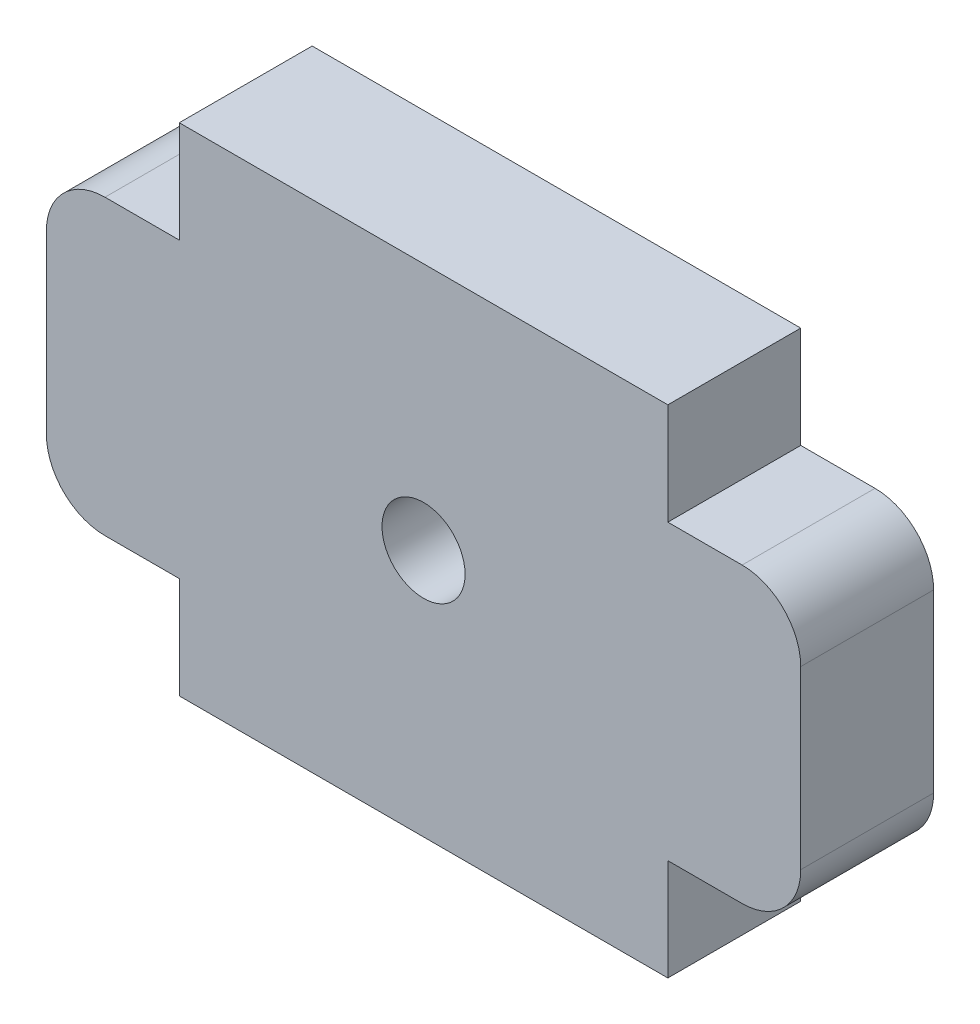
ISO-10303-21;
HEADER;
FILE_DESCRIPTION(('STEP AP214'),'2;1');
FILE_NAME('part.step','',(''),(''),'','','');
FILE_SCHEMA(('AUTOMOTIVE_DESIGN { 1 0 10303 214 1 1 1 1 }'));
ENDSEC;
DATA;
#1=APPLICATION_CONTEXT('core data for automotive mechanical design processes');
#2=APPLICATION_PROTOCOL_DEFINITION('international standard','automotive_design',2000,#1);
#3=PRODUCT_CONTEXT('',#1,'mechanical');
#4=PRODUCT('Part','Part','',(#3));
#5=PRODUCT_RELATED_PRODUCT_CATEGORY('part','',(#4));
#6=PRODUCT_DEFINITION_FORMATION('','',#4);
#7=PRODUCT_DEFINITION_CONTEXT('part definition',#1,'design');
#8=PRODUCT_DEFINITION('design','',#6,#7);
#9=PRODUCT_DEFINITION_SHAPE('','',#8);
#10=(LENGTH_UNIT() NAMED_UNIT(*) SI_UNIT(.MILLI.,.METRE.));
#11=(NAMED_UNIT(*) PLANE_ANGLE_UNIT() SI_UNIT($,.RADIAN.));
#12=(NAMED_UNIT(*) SI_UNIT($,.STERADIAN.) SOLID_ANGLE_UNIT());
#13=UNCERTAINTY_MEASURE_WITH_UNIT(LENGTH_MEASURE(1.E-05),#10,'distance_accuracy_value','');
#14=(GEOMETRIC_REPRESENTATION_CONTEXT(3) GLOBAL_UNCERTAINTY_ASSIGNED_CONTEXT((#13)) GLOBAL_UNIT_ASSIGNED_CONTEXT((#10,
#11,#12)) REPRESENTATION_CONTEXT('',''));
#15=CARTESIAN_POINT('',(0.,0.,0.));
#16=DIRECTION('',(0.,0.,1.));
#17=DIRECTION('',(1.,0.,0.));
#18=AXIS2_PLACEMENT_3D('',#15,#16,#17);
#19=CARTESIAN_POINT('',(-12.5,-12.7,6.8));
#20=DIRECTION('',(1.,0.,0.));
#21=DIRECTION('',(0.,0.,-1.));
#22=AXIS2_PLACEMENT_3D('',#19,#20,#21);
#23=PLANE('',#22);
#24=DIRECTION('',(0.,0.,1.));
#25=VECTOR('',#24,1.);
#26=CARTESIAN_POINT('',(-12.5,-7.5,0.));
#27=LINE('',#26,#25);
#28=CARTESIAN_POINT('',(-12.5,-7.5,0.));
#29=VERTEX_POINT('',#28);
#30=CARTESIAN_POINT('',(-12.5,-7.5,6.8));
#31=VERTEX_POINT('',#30);
#32=EDGE_CURVE('E168',#29,#31,#27,.T.);
#33=ORIENTED_EDGE('',*,*,#32,.F.);
#34=DIRECTION('',(0.,-1.,0.));
#35=VECTOR('',#34,1.);
#36=CARTESIAN_POINT('',(-12.5,-12.7,0.));
#37=LINE('',#36,#35);
#38=CARTESIAN_POINT('',(-12.5,-12.7,0.));
#39=VERTEX_POINT('',#38);
#40=EDGE_CURVE('E176',#29,#39,#37,.T.);
#41=ORIENTED_EDGE('',*,*,#40,.T.);
#42=DIRECTION('',(0.,0.,-1.));
#43=VECTOR('',#42,1.);
#44=CARTESIAN_POINT('',(-12.5,-12.7,6.8));
#45=LINE('',#44,#43);
#46=CARTESIAN_POINT('',(-12.5,-12.7,6.8));
#47=VERTEX_POINT('',#46);
#48=EDGE_CURVE('E204',#47,#39,#45,.T.);
#49=ORIENTED_EDGE('',*,*,#48,.F.);
#50=DIRECTION('',(0.,-1.,0.));
#51=VECTOR('',#50,1.);
#52=CARTESIAN_POINT('',(-12.5,-12.7,6.8));
#53=LINE('',#52,#51);
#54=EDGE_CURVE('E234',#31,#47,#53,.T.);
#55=ORIENTED_EDGE('',*,*,#54,.F.);
#56=EDGE_LOOP('',(#33,#41,#49,#55));
#57=FACE_BOUND('',#56,.T.);
#58=ADVANCED_FACE('F33',(#57),#23,.F.);
#59=CARTESIAN_POINT('',(12.5,-12.7,6.8));
#60=DIRECTION('',(-1.,0.,0.));
#61=DIRECTION('',(0.,0.,1.));
#62=AXIS2_PLACEMENT_3D('',#59,#60,#61);
#63=PLANE('',#62);
#64=DIRECTION('',(0.,0.,1.));
#65=VECTOR('',#64,1.);
#66=CARTESIAN_POINT('',(12.5,7.5,0.));
#67=LINE('',#66,#65);
#68=CARTESIAN_POINT('',(12.5,7.5,0.));
#69=VERTEX_POINT('',#68);
#70=CARTESIAN_POINT('',(12.5,7.5,6.8));
#71=VERTEX_POINT('',#70);
#72=EDGE_CURVE('E180',#69,#71,#67,.T.);
#73=ORIENTED_EDGE('',*,*,#72,.F.);
#74=DIRECTION('',(0.,1.,0.));
#75=VECTOR('',#74,1.);
#76=CARTESIAN_POINT('',(12.5,-12.7,0.));
#77=LINE('',#76,#75);
#78=CARTESIAN_POINT('',(12.5,12.7,0.));
#79=VERTEX_POINT('',#78);
#80=EDGE_CURVE('E178',#69,#79,#77,.T.);
#81=ORIENTED_EDGE('',*,*,#80,.T.);
#82=DIRECTION('',(0.,0.,-1.));
#83=VECTOR('',#82,1.);
#84=CARTESIAN_POINT('',(12.5,12.7,6.8));
#85=LINE('',#84,#83);
#86=CARTESIAN_POINT('',(12.5,12.7,6.8));
#87=VERTEX_POINT('',#86);
#88=EDGE_CURVE('E211',#87,#79,#85,.T.);
#89=ORIENTED_EDGE('',*,*,#88,.F.);
#90=DIRECTION('',(0.,1.,0.));
#91=VECTOR('',#90,1.);
#92=CARTESIAN_POINT('',(12.5,-12.7,6.8));
#93=LINE('',#92,#91);
#94=EDGE_CURVE('E217',#71,#87,#93,.T.);
#95=ORIENTED_EDGE('',*,*,#94,.F.);
#96=EDGE_LOOP('',(#73,#81,#89,#95));
#97=FACE_BOUND('',#96,.T.);
#98=ADVANCED_FACE('F246',(#97),#63,.F.);
#99=CARTESIAN_POINT('',(-12.5,12.7,0.));
#100=VERTEX_POINT('',#99);
#101=CARTESIAN_POINT('',(-12.5,7.5,0.));
#102=VERTEX_POINT('',#101);
#103=EDGE_CURVE('E152',#100,#102,#37,.T.);
#104=ORIENTED_EDGE('',*,*,#103,.T.);
#105=DIRECTION('',(0.,0.,1.));
#106=VECTOR('',#105,1.);
#107=CARTESIAN_POINT('',(-12.5,7.5,0.));
#108=LINE('',#107,#106);
#109=CARTESIAN_POINT('',(-12.5,7.5,6.8));
#110=VERTEX_POINT('',#109);
#111=EDGE_CURVE('E161',#102,#110,#108,.T.);
#112=ORIENTED_EDGE('',*,*,#111,.T.);
#113=CARTESIAN_POINT('',(-12.5,12.7,6.8));
#114=VERTEX_POINT('',#113);
#115=EDGE_CURVE('E227',#114,#110,#53,.T.);
#116=ORIENTED_EDGE('',*,*,#115,.F.);
#117=DIRECTION('',(0.,0.,-1.));
#118=VECTOR('',#117,1.);
#119=CARTESIAN_POINT('',(-12.5,12.7,6.8));
#120=LINE('',#119,#118);
#121=EDGE_CURVE('E174',#114,#100,#120,.T.);
#122=ORIENTED_EDGE('',*,*,#121,.T.);
#123=EDGE_LOOP('',(#104,#112,#116,#122));
#124=FACE_BOUND('',#123,.T.);
#125=ADVANCED_FACE('F172',(#124),#23,.F.);
#126=CARTESIAN_POINT('',(12.5,-12.7,6.8));
#127=DIRECTION('',(0.,1.,0.));
#128=DIRECTION('',(-1.,0.,0.));
#129=AXIS2_PLACEMENT_3D('',#126,#127,#128);
#130=PLANE('',#129);
#131=DIRECTION('',(1.,0.,0.));
#132=VECTOR('',#131,1.);
#133=CARTESIAN_POINT('',(12.5,-12.7,0.));
#134=LINE('',#133,#132);
#135=CARTESIAN_POINT('',(12.5,-12.7,0.));
#136=VERTEX_POINT('',#135);
#137=EDGE_CURVE('E175',#39,#136,#134,.T.);
#138=ORIENTED_EDGE('',*,*,#137,.T.);
#139=DIRECTION('',(0.,0.,-1.));
#140=VECTOR('',#139,1.);
#141=CARTESIAN_POINT('',(12.5,-12.7,6.8));
#142=LINE('',#141,#140);
#143=CARTESIAN_POINT('',(12.5,-12.7,6.8));
#144=VERTEX_POINT('',#143);
#145=EDGE_CURVE('E208',#144,#136,#142,.T.);
#146=ORIENTED_EDGE('',*,*,#145,.F.);
#147=DIRECTION('',(1.,0.,0.));
#148=VECTOR('',#147,1.);
#149=CARTESIAN_POINT('',(12.5,-12.7,6.8));
#150=LINE('',#149,#148);
#151=EDGE_CURVE('E220',#47,#144,#150,.T.);
#152=ORIENTED_EDGE('',*,*,#151,.F.);
#153=ORIENTED_EDGE('',*,*,#48,.T.);
#154=EDGE_LOOP('',(#138,#146,#152,#153));
#155=FACE_BOUND('',#154,.T.);
#156=ADVANCED_FACE('F372',(#155),#130,.F.);
#157=CARTESIAN_POINT('',(12.5,-7.5,0.));
#158=VERTEX_POINT('',#157);
#159=EDGE_CURVE('E201',#136,#158,#77,.T.);
#160=ORIENTED_EDGE('',*,*,#159,.T.);
#161=DIRECTION('',(0.,0.,1.));
#162=VECTOR('',#161,1.);
#163=CARTESIAN_POINT('',(12.5,-7.5,0.));
#164=LINE('',#163,#162);
#165=CARTESIAN_POINT('',(12.5,-7.5,6.8));
#166=VERTEX_POINT('',#165);
#167=EDGE_CURVE('E251',#158,#166,#164,.T.);
#168=ORIENTED_EDGE('',*,*,#167,.T.);
#169=EDGE_CURVE('E213',#144,#166,#93,.T.);
#170=ORIENTED_EDGE('',*,*,#169,.F.);
#171=ORIENTED_EDGE('',*,*,#145,.T.);
#172=EDGE_LOOP('',(#160,#168,#170,#171));
#173=FACE_BOUND('',#172,.T.);
#174=ADVANCED_FACE('F368',(#173),#63,.F.);
#175=CARTESIAN_POINT('',(12.5,12.7,6.8));
#176=DIRECTION('',(0.,-1.,0.));
#177=DIRECTION('',(1.,0.,0.));
#178=AXIS2_PLACEMENT_3D('',#175,#176,#177);
#179=PLANE('',#178);
#180=DIRECTION('',(-1.,0.,0.));
#181=VECTOR('',#180,1.);
#182=CARTESIAN_POINT('',(12.5,12.7,0.));
#183=LINE('',#182,#181);
#184=EDGE_CURVE('E195',#79,#100,#183,.T.);
#185=ORIENTED_EDGE('',*,*,#184,.T.);
#186=ORIENTED_EDGE('',*,*,#121,.F.);
#187=DIRECTION('',(-1.,0.,0.));
#188=VECTOR('',#187,1.);
#189=CARTESIAN_POINT('',(12.5,12.7,6.8));
#190=LINE('',#189,#188);
#191=EDGE_CURVE('E189',#87,#114,#190,.T.);
#192=ORIENTED_EDGE('',*,*,#191,.F.);
#193=ORIENTED_EDGE('',*,*,#88,.T.);
#194=EDGE_LOOP('',(#185,#186,#192,#193));
#195=FACE_BOUND('',#194,.T.);
#196=ADVANCED_FACE('F238',(#195),#179,.F.);
#197=CARTESIAN_POINT('',(0.,0.,6.8));
#198=DIRECTION('',(0.,0.,1.));
#199=DIRECTION('',(1.,0.,0.));
#200=AXIS2_PLACEMENT_3D('',#197,#198,#199);
#201=PLANE('',#200);
#202=CARTESIAN_POINT('',(0.,0.,6.8));
#203=DIRECTION('',(0.,0.,1.));
#204=DIRECTION('',(1.,0.,0.));
#205=AXIS2_PLACEMENT_3D('',#202,#203,#204);
#206=CIRCLE('',#205,2.125);
#207=CARTESIAN_POINT('',(2.125,0.,6.8));
#208=VERTEX_POINT('',#207);
#209=EDGE_CURVE('E419',#208,#208,#206,.T.);
#210=ORIENTED_EDGE('',*,*,#209,.F.);
#211=EDGE_LOOP('',(#210));
#212=FACE_BOUND('',#211,.T.);
#213=DIRECTION('',(1.,0.,0.));
#214=VECTOR('',#213,1.);
#215=CARTESIAN_POINT('',(-19.3,7.5,6.8));
#216=LINE('',#215,#214);
#217=CARTESIAN_POINT('',(-16.3,7.5,6.8));
#218=VERTEX_POINT('',#217);
#219=EDGE_CURVE('E164',#218,#110,#216,.T.);
#220=ORIENTED_EDGE('',*,*,#219,.F.);
#221=CARTESIAN_POINT('',(-16.3,4.5,6.8));
#222=DIRECTION('',(0.,0.,1.));
#223=DIRECTION('',(1.,0.,0.));
#224=AXIS2_PLACEMENT_3D('',#221,#222,#223);
#225=CIRCLE('',#224,3.);
#226=CARTESIAN_POINT('',(-19.3,4.5,6.8));
#227=VERTEX_POINT('',#226);
#228=EDGE_CURVE('E292',#218,#227,#225,.T.);
#229=ORIENTED_EDGE('',*,*,#228,.T.);
#230=DIRECTION('',(0.,1.,0.));
#231=VECTOR('',#230,1.);
#232=CARTESIAN_POINT('',(-19.3,-7.5,6.8));
#233=LINE('',#232,#231);
#234=CARTESIAN_POINT('',(-19.3,-4.5,6.8));
#235=VERTEX_POINT('',#234);
#236=EDGE_CURVE('E283',#235,#227,#233,.T.);
#237=ORIENTED_EDGE('',*,*,#236,.F.);
#238=CARTESIAN_POINT('',(-16.3,-4.5,6.8));
#239=DIRECTION('',(0.,0.,1.));
#240=DIRECTION('',(1.,0.,0.));
#241=AXIS2_PLACEMENT_3D('',#238,#239,#240);
#242=CIRCLE('',#241,3.);
#243=CARTESIAN_POINT('',(-16.3,-7.5,6.8));
#244=VERTEX_POINT('',#243);
#245=EDGE_CURVE('E290',#235,#244,#242,.T.);
#246=ORIENTED_EDGE('',*,*,#245,.T.);
#247=DIRECTION('',(-1.,0.,0.));
#248=VECTOR('',#247,1.);
#249=CARTESIAN_POINT('',(-19.3,-7.5,6.8));
#250=LINE('',#249,#248);
#251=EDGE_CURVE('E158',#31,#244,#250,.T.);
#252=ORIENTED_EDGE('',*,*,#251,.F.);
#253=ORIENTED_EDGE('',*,*,#54,.T.);
#254=ORIENTED_EDGE('',*,*,#151,.T.);
#255=ORIENTED_EDGE('',*,*,#169,.T.);
#256=DIRECTION('',(1.,0.,0.));
#257=VECTOR('',#256,1.);
#258=CARTESIAN_POINT('',(19.3,-7.5,6.8));
#259=LINE('',#258,#257);
#260=CARTESIAN_POINT('',(16.3,-7.5,6.8));
#261=VERTEX_POINT('',#260);
#262=EDGE_CURVE('E267',#166,#261,#259,.T.);
#263=ORIENTED_EDGE('',*,*,#262,.T.);
#264=CARTESIAN_POINT('',(16.3,-4.5,6.8));
#265=DIRECTION('',(0.,0.,1.));
#266=DIRECTION('',(1.,0.,0.));
#267=AXIS2_PLACEMENT_3D('',#264,#265,#266);
#268=CIRCLE('',#267,3.);
#269=CARTESIAN_POINT('',(19.3,-4.5,6.8));
#270=VERTEX_POINT('',#269);
#271=EDGE_CURVE('E325',#261,#270,#268,.T.);
#272=ORIENTED_EDGE('',*,*,#271,.T.);
#273=DIRECTION('',(0.,1.,0.));
#274=VECTOR('',#273,1.);
#275=CARTESIAN_POINT('',(19.3,-7.5,6.8));
#276=LINE('',#275,#274);
#277=CARTESIAN_POINT('',(19.3,4.5,6.8));
#278=VERTEX_POINT('',#277);
#279=EDGE_CURVE('E263',#270,#278,#276,.T.);
#280=ORIENTED_EDGE('',*,*,#279,.T.);
#281=CARTESIAN_POINT('',(16.3,4.5,6.8));
#282=DIRECTION('',(0.,0.,1.));
#283=DIRECTION('',(1.,0.,0.));
#284=AXIS2_PLACEMENT_3D('',#281,#282,#283);
#285=CIRCLE('',#284,3.);
#286=CARTESIAN_POINT('',(16.3,7.5,6.8));
#287=VERTEX_POINT('',#286);
#288=EDGE_CURVE('E334',#278,#287,#285,.T.);
#289=ORIENTED_EDGE('',*,*,#288,.T.);
#290=DIRECTION('',(-1.,0.,0.));
#291=VECTOR('',#290,1.);
#292=CARTESIAN_POINT('',(19.3,7.5,6.8));
#293=LINE('',#292,#291);
#294=EDGE_CURVE('E266',#287,#71,#293,.T.);
#295=ORIENTED_EDGE('',*,*,#294,.T.);
#296=ORIENTED_EDGE('',*,*,#94,.T.);
#297=ORIENTED_EDGE('',*,*,#191,.T.);
#298=ORIENTED_EDGE('',*,*,#115,.T.);
#299=EDGE_LOOP('',(#220,#229,#237,#246,#252,#253,#254,#255,#263,#272,#280,#289,#295,#296,#297,#298));
#300=FACE_BOUND('',#299,.T.);
#301=ADVANCED_FACE('F306',(#212,#300),#201,.T.);
#302=CARTESIAN_POINT('',(0.,0.,0.));
#303=DIRECTION('',(0.,0.,1.));
#304=DIRECTION('',(1.,0.,0.));
#305=AXIS2_PLACEMENT_3D('',#302,#303,#304);
#306=PLANE('',#305);
#307=CARTESIAN_POINT('',(0.,0.,0.));
#308=DIRECTION('',(0.,0.,1.));
#309=DIRECTION('',(1.,0.,0.));
#310=AXIS2_PLACEMENT_3D('',#307,#308,#309);
#311=CIRCLE('',#310,2.125);
#312=CARTESIAN_POINT('',(2.125,0.,0.));
#313=VERTEX_POINT('',#312);
#314=EDGE_CURVE('E284',#313,#313,#311,.T.);
#315=ORIENTED_EDGE('',*,*,#314,.T.);
#316=EDGE_LOOP('',(#315));
#317=FACE_BOUND('',#316,.T.);
#318=DIRECTION('',(0.,1.,0.));
#319=VECTOR('',#318,1.);
#320=CARTESIAN_POINT('',(-19.3,-7.5,0.));
#321=LINE('',#320,#319);
#322=CARTESIAN_POINT('',(-19.3,-4.5,0.));
#323=VERTEX_POINT('',#322);
#324=CARTESIAN_POINT('',(-19.3,4.5,0.));
#325=VERTEX_POINT('',#324);
#326=EDGE_CURVE('E157',#323,#325,#321,.T.);
#327=ORIENTED_EDGE('',*,*,#326,.T.);
#328=CARTESIAN_POINT('',(-16.3,4.5,0.));
#329=DIRECTION('',(0.,0.,1.));
#330=DIRECTION('',(1.,0.,0.));
#331=AXIS2_PLACEMENT_3D('',#328,#329,#330);
#332=CIRCLE('',#331,3.);
#333=CARTESIAN_POINT('',(-16.3,7.5,0.));
#334=VERTEX_POINT('',#333);
#335=EDGE_CURVE('E41',#325,#334,#332,.F.);
#336=ORIENTED_EDGE('',*,*,#335,.T.);
#337=DIRECTION('',(1.,0.,0.));
#338=VECTOR('',#337,1.);
#339=CARTESIAN_POINT('',(-19.3,7.5,0.));
#340=LINE('',#339,#338);
#341=EDGE_CURVE('E147',#334,#102,#340,.T.);
#342=ORIENTED_EDGE('',*,*,#341,.T.);
#343=ORIENTED_EDGE('',*,*,#103,.F.);
#344=ORIENTED_EDGE('',*,*,#184,.F.);
#345=ORIENTED_EDGE('',*,*,#80,.F.);
#346=DIRECTION('',(-1.,0.,0.));
#347=VECTOR('',#346,1.);
#348=CARTESIAN_POINT('',(19.3,7.5,0.));
#349=LINE('',#348,#347);
#350=CARTESIAN_POINT('',(16.3,7.5,0.));
#351=VERTEX_POINT('',#350);
#352=EDGE_CURVE('E242',#351,#69,#349,.T.);
#353=ORIENTED_EDGE('',*,*,#352,.F.);
#354=CARTESIAN_POINT('',(16.3,4.5,0.));
#355=DIRECTION('',(0.,0.,1.));
#356=DIRECTION('',(1.,0.,0.));
#357=AXIS2_PLACEMENT_3D('',#354,#355,#356);
#358=CIRCLE('',#357,3.);
#359=CARTESIAN_POINT('',(19.3,4.5,0.));
#360=VERTEX_POINT('',#359);
#361=EDGE_CURVE('E340',#351,#360,#358,.F.);
#362=ORIENTED_EDGE('',*,*,#361,.T.);
#363=DIRECTION('',(0.,1.,0.));
#364=VECTOR('',#363,1.);
#365=CARTESIAN_POINT('',(19.3,-7.5,0.));
#366=LINE('',#365,#364);
#367=CARTESIAN_POINT('',(19.3,-4.5,0.));
#368=VERTEX_POINT('',#367);
#369=EDGE_CURVE('E268',#368,#360,#366,.T.);
#370=ORIENTED_EDGE('',*,*,#369,.F.);
#371=CARTESIAN_POINT('',(16.3,-4.5,0.));
#372=DIRECTION('',(0.,0.,1.));
#373=DIRECTION('',(1.,0.,0.));
#374=AXIS2_PLACEMENT_3D('',#371,#372,#373);
#375=CIRCLE('',#374,3.);
#376=CARTESIAN_POINT('',(16.3,-7.5,0.));
#377=VERTEX_POINT('',#376);
#378=EDGE_CURVE('E336',#368,#377,#375,.F.);
#379=ORIENTED_EDGE('',*,*,#378,.T.);
#380=DIRECTION('',(1.,0.,0.));
#381=VECTOR('',#380,1.);
#382=CARTESIAN_POINT('',(19.3,-7.5,0.));
#383=LINE('',#382,#381);
#384=EDGE_CURVE('E271',#158,#377,#383,.T.);
#385=ORIENTED_EDGE('',*,*,#384,.F.);
#386=ORIENTED_EDGE('',*,*,#159,.F.);
#387=ORIENTED_EDGE('',*,*,#137,.F.);
#388=ORIENTED_EDGE('',*,*,#40,.F.);
#389=DIRECTION('',(-1.,0.,0.));
#390=VECTOR('',#389,1.);
#391=CARTESIAN_POINT('',(-19.3,-7.5,0.));
#392=LINE('',#391,#390);
#393=CARTESIAN_POINT('',(-16.3,-7.5,0.));
#394=VERTEX_POINT('',#393);
#395=EDGE_CURVE('E169',#29,#394,#392,.T.);
#396=ORIENTED_EDGE('',*,*,#395,.T.);
#397=CARTESIAN_POINT('',(-16.3,-4.5,0.));
#398=DIRECTION('',(0.,0.,1.));
#399=DIRECTION('',(1.,0.,0.));
#400=AXIS2_PLACEMENT_3D('',#397,#398,#399);
#401=CIRCLE('',#400,3.);
#402=EDGE_CURVE('E298',#394,#323,#401,.F.);
#403=ORIENTED_EDGE('',*,*,#402,.T.);
#404=EDGE_LOOP('',(#327,#336,#342,#343,#344,#345,#353,#362,#370,#379,#385,#386,#387,#388,#396,#403));
#405=FACE_BOUND('',#404,.T.);
#406=ADVANCED_FACE('F149',(#317,#405),#306,.F.);
#407=CARTESIAN_POINT('',(19.3,7.5,0.));
#408=DIRECTION('',(0.,1.,0.));
#409=DIRECTION('',(-1.,0.,0.));
#410=AXIS2_PLACEMENT_3D('',#407,#408,#409);
#411=PLANE('',#410);
#412=ORIENTED_EDGE('',*,*,#294,.F.);
#413=DIRECTION('',(0.,0.,1.));
#414=VECTOR('',#413,1.);
#415=CARTESIAN_POINT('',(16.3,7.5,0.));
#416=LINE('',#415,#414);
#417=EDGE_CURVE('E335',#287,#351,#416,.F.);
#418=ORIENTED_EDGE('',*,*,#417,.T.);
#419=ORIENTED_EDGE('',*,*,#352,.T.);
#420=ORIENTED_EDGE('',*,*,#72,.T.);
#421=EDGE_LOOP('',(#412,#418,#419,#420));
#422=FACE_BOUND('',#421,.T.);
#423=ADVANCED_FACE('F350',(#422),#411,.T.);
#424=CARTESIAN_POINT('',(19.3,-7.5,0.));
#425=DIRECTION('',(1.,0.,0.));
#426=DIRECTION('',(0.,0.,-1.));
#427=AXIS2_PLACEMENT_3D('',#424,#425,#426);
#428=PLANE('',#427);
#429=ORIENTED_EDGE('',*,*,#369,.T.);
#430=DIRECTION('',(0.,0.,1.));
#431=VECTOR('',#430,1.);
#432=CARTESIAN_POINT('',(19.3,4.5,0.));
#433=LINE('',#432,#431);
#434=EDGE_CURVE('E323',#360,#278,#433,.T.);
#435=ORIENTED_EDGE('',*,*,#434,.T.);
#436=ORIENTED_EDGE('',*,*,#279,.F.);
#437=DIRECTION('',(0.,0.,1.));
#438=VECTOR('',#437,1.);
#439=CARTESIAN_POINT('',(19.3,-4.5,0.));
#440=LINE('',#439,#438);
#441=EDGE_CURVE('E207',#270,#368,#440,.F.);
#442=ORIENTED_EDGE('',*,*,#441,.T.);
#443=EDGE_LOOP('',(#429,#435,#436,#442));
#444=FACE_BOUND('',#443,.T.);
#445=ADVANCED_FACE('F346',(#444),#428,.T.);
#446=CARTESIAN_POINT('',(19.3,-7.5,0.));
#447=DIRECTION('',(0.,-1.,0.));
#448=DIRECTION('',(1.,0.,0.));
#449=AXIS2_PLACEMENT_3D('',#446,#447,#448);
#450=PLANE('',#449);
#451=ORIENTED_EDGE('',*,*,#384,.T.);
#452=DIRECTION('',(0.,0.,1.));
#453=VECTOR('',#452,1.);
#454=CARTESIAN_POINT('',(16.3,-7.5,0.));
#455=LINE('',#454,#453);
#456=EDGE_CURVE('E184',#377,#261,#455,.T.);
#457=ORIENTED_EDGE('',*,*,#456,.T.);
#458=ORIENTED_EDGE('',*,*,#262,.F.);
#459=ORIENTED_EDGE('',*,*,#167,.F.);
#460=EDGE_LOOP('',(#451,#457,#458,#459));
#461=FACE_BOUND('',#460,.T.);
#462=ADVANCED_FACE('F341',(#461),#450,.T.);
#463=CARTESIAN_POINT('',(16.3,4.5,0.));
#464=DIRECTION('',(0.,0.,1.));
#465=DIRECTION('',(1.,0.,0.));
#466=AXIS2_PLACEMENT_3D('',#463,#464,#465);
#467=CYLINDRICAL_SURFACE('',#466,3.);
#468=ORIENTED_EDGE('',*,*,#361,.F.);
#469=ORIENTED_EDGE('',*,*,#417,.F.);
#470=ORIENTED_EDGE('',*,*,#288,.F.);
#471=ORIENTED_EDGE('',*,*,#434,.F.);
#472=EDGE_LOOP('',(#468,#469,#470,#471));
#473=FACE_BOUND('',#472,.T.);
#474=ADVANCED_FACE('F348',(#473),#467,.T.);
#475=CARTESIAN_POINT('',(16.3,-4.5,0.));
#476=DIRECTION('',(0.,0.,1.));
#477=DIRECTION('',(1.,0.,0.));
#478=AXIS2_PLACEMENT_3D('',#475,#476,#477);
#479=CYLINDRICAL_SURFACE('',#478,3.);
#480=ORIENTED_EDGE('',*,*,#378,.F.);
#481=ORIENTED_EDGE('',*,*,#441,.F.);
#482=ORIENTED_EDGE('',*,*,#271,.F.);
#483=ORIENTED_EDGE('',*,*,#456,.F.);
#484=EDGE_LOOP('',(#480,#481,#482,#483));
#485=FACE_BOUND('',#484,.T.);
#486=ADVANCED_FACE('F344',(#485),#479,.T.);
#487=CARTESIAN_POINT('',(-19.3,-7.5,0.));
#488=DIRECTION('',(0.,1.,0.));
#489=DIRECTION('',(-1.,0.,0.));
#490=AXIS2_PLACEMENT_3D('',#487,#488,#489);
#491=PLANE('',#490);
#492=ORIENTED_EDGE('',*,*,#251,.T.);
#493=DIRECTION('',(0.,0.,1.));
#494=VECTOR('',#493,1.);
#495=CARTESIAN_POINT('',(-16.3,-7.5,0.));
#496=LINE('',#495,#494);
#497=EDGE_CURVE('E11',#244,#394,#496,.F.);
#498=ORIENTED_EDGE('',*,*,#497,.T.);
#499=ORIENTED_EDGE('',*,*,#395,.F.);
#500=ORIENTED_EDGE('',*,*,#32,.T.);
#501=EDGE_LOOP('',(#492,#498,#499,#500));
#502=FACE_BOUND('',#501,.T.);
#503=ADVANCED_FACE('F308',(#502),#491,.F.);
#504=CARTESIAN_POINT('',(-19.3,-7.5,0.));
#505=DIRECTION('',(1.,0.,0.));
#506=DIRECTION('',(0.,0.,-1.));
#507=AXIS2_PLACEMENT_3D('',#504,#505,#506);
#508=PLANE('',#507);
#509=ORIENTED_EDGE('',*,*,#236,.T.);
#510=DIRECTION('',(0.,0.,1.));
#511=VECTOR('',#510,1.);
#512=CARTESIAN_POINT('',(-19.3,4.5,0.));
#513=LINE('',#512,#511);
#514=EDGE_CURVE('E54',#227,#325,#513,.F.);
#515=ORIENTED_EDGE('',*,*,#514,.T.);
#516=ORIENTED_EDGE('',*,*,#326,.F.);
#517=DIRECTION('',(0.,0.,1.));
#518=VECTOR('',#517,1.);
#519=CARTESIAN_POINT('',(-19.3,-4.5,0.));
#520=LINE('',#519,#518);
#521=EDGE_CURVE('E294',#323,#235,#520,.T.);
#522=ORIENTED_EDGE('',*,*,#521,.T.);
#523=EDGE_LOOP('',(#509,#515,#516,#522));
#524=FACE_BOUND('',#523,.T.);
#525=ADVANCED_FACE('F303',(#524),#508,.F.);
#526=CARTESIAN_POINT('',(-19.3,7.5,0.));
#527=DIRECTION('',(0.,-1.,0.));
#528=DIRECTION('',(1.,0.,0.));
#529=AXIS2_PLACEMENT_3D('',#526,#527,#528);
#530=PLANE('',#529);
#531=ORIENTED_EDGE('',*,*,#341,.F.);
#532=DIRECTION('',(0.,0.,1.));
#533=VECTOR('',#532,1.);
#534=CARTESIAN_POINT('',(-16.3,7.5,0.));
#535=LINE('',#534,#533);
#536=EDGE_CURVE('E288',#334,#218,#535,.T.);
#537=ORIENTED_EDGE('',*,*,#536,.T.);
#538=ORIENTED_EDGE('',*,*,#219,.T.);
#539=ORIENTED_EDGE('',*,*,#111,.F.);
#540=EDGE_LOOP('',(#531,#537,#538,#539));
#541=FACE_BOUND('',#540,.T.);
#542=ADVANCED_FACE('F162',(#541),#530,.F.);
#543=CARTESIAN_POINT('',(-16.3,4.5,0.));
#544=DIRECTION('',(0.,0.,1.));
#545=DIRECTION('',(1.,0.,0.));
#546=AXIS2_PLACEMENT_3D('',#543,#544,#545);
#547=CYLINDRICAL_SURFACE('',#546,3.);
#548=ORIENTED_EDGE('',*,*,#335,.F.);
#549=ORIENTED_EDGE('',*,*,#514,.F.);
#550=ORIENTED_EDGE('',*,*,#228,.F.);
#551=ORIENTED_EDGE('',*,*,#536,.F.);
#552=EDGE_LOOP('',(#548,#549,#550,#551));
#553=FACE_BOUND('',#552,.T.);
#554=ADVANCED_FACE('F395',(#553),#547,.T.);
#555=CARTESIAN_POINT('',(-16.3,-4.5,0.));
#556=DIRECTION('',(0.,0.,1.));
#557=DIRECTION('',(1.,0.,0.));
#558=AXIS2_PLACEMENT_3D('',#555,#556,#557);
#559=CYLINDRICAL_SURFACE('',#558,3.);
#560=ORIENTED_EDGE('',*,*,#402,.F.);
#561=ORIENTED_EDGE('',*,*,#497,.F.);
#562=ORIENTED_EDGE('',*,*,#245,.F.);
#563=ORIENTED_EDGE('',*,*,#521,.F.);
#564=EDGE_LOOP('',(#560,#561,#562,#563));
#565=FACE_BOUND('',#564,.T.);
#566=ADVANCED_FACE('F35',(#565),#559,.T.);
#567=CARTESIAN_POINT('',(0.,0.,0.));
#568=DIRECTION('',(0.,0.,1.));
#569=DIRECTION('',(1.,0.,0.));
#570=AXIS2_PLACEMENT_3D('',#567,#568,#569);
#571=CYLINDRICAL_SURFACE('',#570,2.125);
#572=ORIENTED_EDGE('',*,*,#314,.F.);
#573=EDGE_LOOP('',(#572));
#574=FACE_BOUND('',#573,.T.);
#575=ORIENTED_EDGE('',*,*,#209,.T.);
#576=EDGE_LOOP('',(#575));
#577=FACE_BOUND('',#576,.T.);
#578=ADVANCED_FACE('F402',(#574,#577),#571,.F.);
#579=CLOSED_SHELL('',(#58,#98,#125,#156,#174,#196,#301,#406,#423,#445,#462,#474,#486,#503,#525,
#542,#554,#566,#578));
#580=MANIFOLD_SOLID_BREP('B2',#579);
#581=ADVANCED_BREP_SHAPE_REPRESENTATION('',(#18,#580),#14);
#582=SHAPE_DEFINITION_REPRESENTATION(#9,#581);
ENDSEC;
END-ISO-10303-21;
